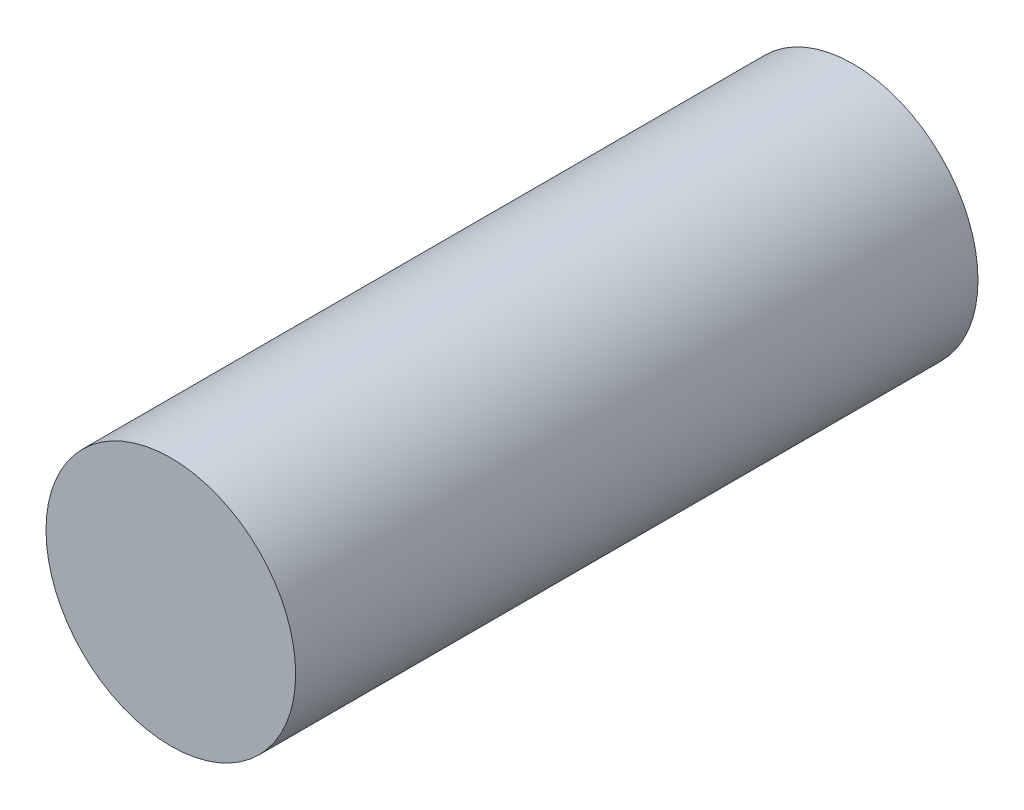
ISO-10303-21;
HEADER;
FILE_DESCRIPTION(('STEP AP214'),'2;1');
FILE_NAME('part.step','',(''),(''),'','','');
FILE_SCHEMA(('AUTOMOTIVE_DESIGN { 1 0 10303 214 1 1 1 1 }'));
ENDSEC;
DATA;
#1=APPLICATION_CONTEXT('core data for automotive mechanical design processes');
#2=APPLICATION_PROTOCOL_DEFINITION('international standard','automotive_design',2000,#1);
#3=PRODUCT_CONTEXT('',#1,'mechanical');
#4=PRODUCT('Part','Part','',(#3));
#5=PRODUCT_RELATED_PRODUCT_CATEGORY('part','',(#4));
#6=PRODUCT_DEFINITION_FORMATION('','',#4);
#7=PRODUCT_DEFINITION_CONTEXT('part definition',#1,'design');
#8=PRODUCT_DEFINITION('design','',#6,#7);
#9=PRODUCT_DEFINITION_SHAPE('','',#8);
#10=(LENGTH_UNIT() NAMED_UNIT(*) SI_UNIT(.MILLI.,.METRE.));
#11=(NAMED_UNIT(*) PLANE_ANGLE_UNIT() SI_UNIT($,.RADIAN.));
#12=(NAMED_UNIT(*) SI_UNIT($,.STERADIAN.) SOLID_ANGLE_UNIT());
#13=UNCERTAINTY_MEASURE_WITH_UNIT(LENGTH_MEASURE(1.E-05),#10,'distance_accuracy_value','');
#14=(GEOMETRIC_REPRESENTATION_CONTEXT(3) GLOBAL_UNCERTAINTY_ASSIGNED_CONTEXT((#13)) GLOBAL_UNIT_ASSIGNED_CONTEXT((#10,
#11,#12)) REPRESENTATION_CONTEXT('',''));
#15=CARTESIAN_POINT('',(0.,0.,0.));
#16=DIRECTION('',(0.,0.,1.));
#17=DIRECTION('',(1.,0.,0.));
#18=AXIS2_PLACEMENT_3D('',#15,#16,#17);
#19=CARTESIAN_POINT('',(0.,0.,16.4));
#20=DIRECTION('',(0.,0.,-1.));
#21=DIRECTION('',(-1.,0.,0.));
#22=AXIS2_PLACEMENT_3D('',#19,#20,#21);
#23=CYLINDRICAL_SURFACE('',#22,3.);
#24=CARTESIAN_POINT('',(0.,0.,16.4));
#25=DIRECTION('',(0.,0.,1.));
#26=DIRECTION('',(1.,0.,0.));
#27=AXIS2_PLACEMENT_3D('',#24,#25,#26);
#28=CIRCLE('',#27,3.);
#29=CARTESIAN_POINT('',(3.,0.,16.4));
#30=VERTEX_POINT('',#29);
#31=EDGE_CURVE('E10',#30,#30,#28,.T.);
#32=ORIENTED_EDGE('',*,*,#31,.F.);
#33=EDGE_LOOP('',(#32));
#34=FACE_BOUND('',#33,.T.);
#35=CARTESIAN_POINT('',(0.,0.,0.));
#36=DIRECTION('',(0.,0.,1.));
#37=DIRECTION('',(1.,0.,0.));
#38=AXIS2_PLACEMENT_3D('',#35,#36,#37);
#39=CIRCLE('',#38,3.);
#40=CARTESIAN_POINT('',(3.,0.,0.));
#41=VERTEX_POINT('',#40);
#42=EDGE_CURVE('E35',#41,#41,#39,.T.);
#43=ORIENTED_EDGE('',*,*,#42,.T.);
#44=EDGE_LOOP('',(#43));
#45=FACE_BOUND('',#44,.T.);
#46=ADVANCED_FACE('F32',(#34,#45),#23,.T.);
#47=CARTESIAN_POINT('',(0.,0.,16.4));
#48=DIRECTION('',(0.,0.,1.));
#49=DIRECTION('',(1.,0.,0.));
#50=AXIS2_PLACEMENT_3D('',#47,#48,#49);
#51=PLANE('',#50);
#52=ORIENTED_EDGE('',*,*,#31,.T.);
#53=EDGE_LOOP('',(#52));
#54=FACE_BOUND('',#53,.T.);
#55=ADVANCED_FACE('F47',(#54),#51,.T.);
#56=CARTESIAN_POINT('',(0.,0.,0.));
#57=DIRECTION('',(0.,0.,1.));
#58=DIRECTION('',(1.,0.,0.));
#59=AXIS2_PLACEMENT_3D('',#56,#57,#58);
#60=PLANE('',#59);
#61=ORIENTED_EDGE('',*,*,#42,.F.);
#62=EDGE_LOOP('',(#61));
#63=FACE_BOUND('',#62,.T.);
#64=ADVANCED_FACE('F45',(#63),#60,.F.);
#65=CLOSED_SHELL('',(#46,#55,#64));
#66=MANIFOLD_SOLID_BREP('B2',#65);
#67=ADVANCED_BREP_SHAPE_REPRESENTATION('',(#18,#66),#14);
#68=SHAPE_DEFINITION_REPRESENTATION(#9,#67);
ENDSEC;
END-ISO-10303-21;
